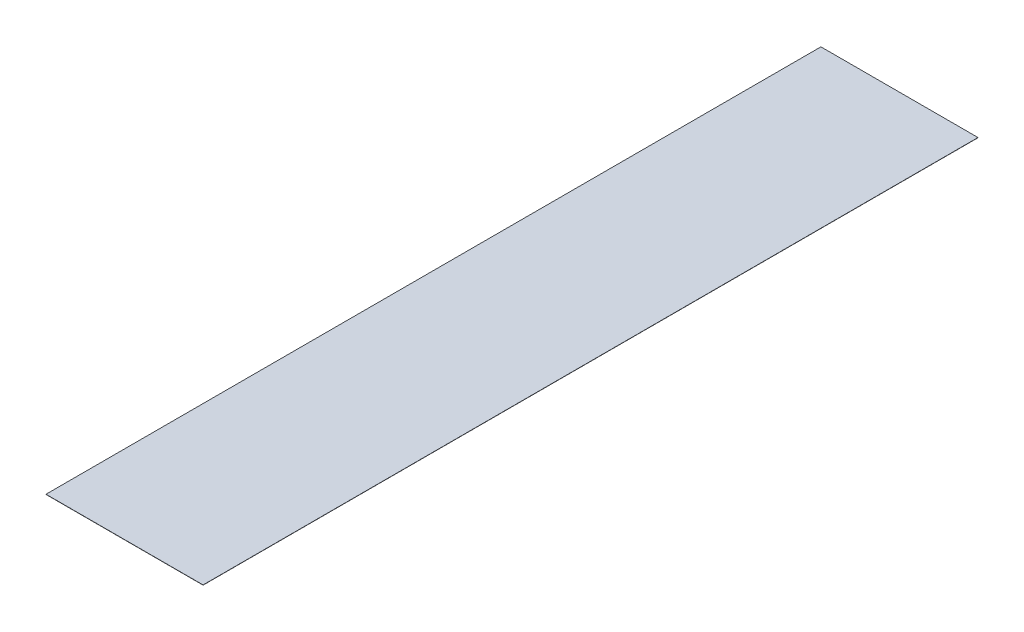
ISO-10303-21;
HEADER;
FILE_DESCRIPTION(('STEP AP214'),'2;1');
FILE_NAME('part.step','',(''),(''),'','','');
FILE_SCHEMA(('AUTOMOTIVE_DESIGN { 1 0 10303 214 1 1 1 1 }'));
ENDSEC;
DATA;
#1=APPLICATION_CONTEXT('core data for automotive mechanical design processes');
#2=APPLICATION_PROTOCOL_DEFINITION('international standard','automotive_design',2000,#1);
#3=PRODUCT_CONTEXT('',#1,'mechanical');
#4=PRODUCT('Part','Part','',(#3));
#5=PRODUCT_RELATED_PRODUCT_CATEGORY('part','',(#4));
#6=PRODUCT_DEFINITION_FORMATION('','',#4);
#7=PRODUCT_DEFINITION_CONTEXT('part definition',#1,'design');
#8=PRODUCT_DEFINITION('design','',#6,#7);
#9=PRODUCT_DEFINITION_SHAPE('','',#8);
#10=(LENGTH_UNIT() NAMED_UNIT(*) SI_UNIT(.MILLI.,.METRE.));
#11=(NAMED_UNIT(*) PLANE_ANGLE_UNIT() SI_UNIT($,.RADIAN.));
#12=(NAMED_UNIT(*) SI_UNIT($,.STERADIAN.) SOLID_ANGLE_UNIT());
#13=UNCERTAINTY_MEASURE_WITH_UNIT(LENGTH_MEASURE(1.E-05),#10,'distance_accuracy_value','');
#14=(GEOMETRIC_REPRESENTATION_CONTEXT(3) GLOBAL_UNCERTAINTY_ASSIGNED_CONTEXT((#13)) GLOBAL_UNIT_ASSIGNED_CONTEXT((#10,
#11,#12)) REPRESENTATION_CONTEXT('',''));
#15=CARTESIAN_POINT('',(0.,0.,0.));
#16=DIRECTION('',(0.,0.,1.));
#17=DIRECTION('',(1.,0.,0.));
#18=AXIS2_PLACEMENT_3D('',#15,#16,#17);
#19=CARTESIAN_POINT('',(0.,6.35,0.));
#20=DIRECTION('',(0.,1.,0.));
#21=DIRECTION('',(0.,0.,1.));
#22=AXIS2_PLACEMENT_3D('',#19,#20,#21);
#23=PLANE('',#22);
#24=DIRECTION('',(-1.,0.,0.));
#25=VECTOR('',#24,1.);
#26=CARTESIAN_POINT('',(2286.,6.35,-11277.6));
#27=LINE('',#26,#25);
#28=CARTESIAN_POINT('',(-2286.,6.35,-11277.6));
#29=VERTEX_POINT('',#28);
#30=CARTESIAN_POINT('',(2286.,6.35,-11277.6));
#31=VERTEX_POINT('',#30);
#32=EDGE_CURVE('E68',#29,#31,#27,.F.);
#33=ORIENTED_EDGE('',*,*,#32,.F.);
#34=DIRECTION('',(0.,0.,1.));
#35=VECTOR('',#34,1.);
#36=CARTESIAN_POINT('',(-2286.,6.35,-11277.6));
#37=LINE('',#36,#35);
#38=CARTESIAN_POINT('',(-2286.,6.35,11277.6));
#39=VERTEX_POINT('',#38);
#40=EDGE_CURVE('E20',#39,#29,#37,.F.);
#41=ORIENTED_EDGE('',*,*,#40,.F.);
#42=DIRECTION('',(1.,0.,0.));
#43=VECTOR('',#42,1.);
#44=CARTESIAN_POINT('',(-2286.,6.35,11277.6));
#45=LINE('',#44,#43);
#46=CARTESIAN_POINT('',(2286.,6.35,11277.6));
#47=VERTEX_POINT('',#46);
#48=EDGE_CURVE('E58',#47,#39,#45,.F.);
#49=ORIENTED_EDGE('',*,*,#48,.F.);
#50=DIRECTION('',(0.,0.,-1.));
#51=VECTOR('',#50,1.);
#52=CARTESIAN_POINT('',(2286.,6.35,11277.6));
#53=LINE('',#52,#51);
#54=EDGE_CURVE('E53',#31,#47,#53,.F.);
#55=ORIENTED_EDGE('',*,*,#54,.F.);
#56=EDGE_LOOP('',(#33,#41,#49,#55));
#57=FACE_BOUND('',#56,.T.);
#58=ADVANCED_FACE('F17',(#57),#23,.T.);
#59=CARTESIAN_POINT('',(-2286.,0.,-11277.6));
#60=DIRECTION('',(-1.,0.,0.));
#61=DIRECTION('',(0.,0.,1.));
#62=AXIS2_PLACEMENT_3D('',#59,#60,#61);
#63=PLANE('',#62);
#64=DIRECTION('',(0.,1.,0.));
#65=VECTOR('',#64,1.);
#66=CARTESIAN_POINT('',(-2286.,0.,-11277.6));
#67=LINE('',#66,#65);
#68=CARTESIAN_POINT('',(-2286.,0.,-11277.6));
#69=VERTEX_POINT('',#68);
#70=EDGE_CURVE('E79',#69,#29,#67,.T.);
#71=ORIENTED_EDGE('',*,*,#70,.F.);
#72=DIRECTION('',(0.,0.,1.));
#73=VECTOR('',#72,1.);
#74=CARTESIAN_POINT('',(-2286.,0.,0.));
#75=LINE('',#74,#73);
#76=CARTESIAN_POINT('',(-2286.,0.,11277.6));
#77=VERTEX_POINT('',#76);
#78=EDGE_CURVE('E74',#69,#77,#75,.T.);
#79=ORIENTED_EDGE('',*,*,#78,.T.);
#80=DIRECTION('',(0.,1.,0.));
#81=VECTOR('',#80,1.);
#82=CARTESIAN_POINT('',(-2286.,0.,11277.6));
#83=LINE('',#82,#81);
#84=EDGE_CURVE('E63',#39,#77,#83,.F.);
#85=ORIENTED_EDGE('',*,*,#84,.F.);
#86=ORIENTED_EDGE('',*,*,#40,.T.);
#87=EDGE_LOOP('',(#71,#79,#85,#86));
#88=FACE_BOUND('',#87,.T.);
#89=ADVANCED_FACE('F73',(#88),#63,.T.);
#90=CARTESIAN_POINT('',(-2286.,0.,11277.6));
#91=DIRECTION('',(0.,0.,1.));
#92=DIRECTION('',(1.,0.,0.));
#93=AXIS2_PLACEMENT_3D('',#90,#91,#92);
#94=PLANE('',#93);
#95=ORIENTED_EDGE('',*,*,#84,.T.);
#96=DIRECTION('',(1.,0.,0.));
#97=VECTOR('',#96,1.);
#98=CARTESIAN_POINT('',(0.,0.,11277.6));
#99=LINE('',#98,#97);
#100=CARTESIAN_POINT('',(2286.,0.,11277.6));
#101=VERTEX_POINT('',#100);
#102=EDGE_CURVE('E84',#77,#101,#99,.T.);
#103=ORIENTED_EDGE('',*,*,#102,.T.);
#104=DIRECTION('',(0.,1.,0.));
#105=VECTOR('',#104,1.);
#106=CARTESIAN_POINT('',(2286.,0.,11277.6));
#107=LINE('',#106,#105);
#108=EDGE_CURVE('E65',#47,#101,#107,.F.);
#109=ORIENTED_EDGE('',*,*,#108,.F.);
#110=ORIENTED_EDGE('',*,*,#48,.T.);
#111=EDGE_LOOP('',(#95,#103,#109,#110));
#112=FACE_BOUND('',#111,.T.);
#113=ADVANCED_FACE('F60',(#112),#94,.T.);
#114=CARTESIAN_POINT('',(2286.,0.,11277.6));
#115=DIRECTION('',(1.,0.,0.));
#116=DIRECTION('',(0.,0.,-1.));
#117=AXIS2_PLACEMENT_3D('',#114,#115,#116);
#118=PLANE('',#117);
#119=ORIENTED_EDGE('',*,*,#108,.T.);
#120=DIRECTION('',(0.,0.,1.));
#121=VECTOR('',#120,1.);
#122=CARTESIAN_POINT('',(2286.,0.,0.));
#123=LINE('',#122,#121);
#124=CARTESIAN_POINT('',(2286.,0.,-11277.6));
#125=VERTEX_POINT('',#124);
#126=EDGE_CURVE('E26',#101,#125,#123,.F.);
#127=ORIENTED_EDGE('',*,*,#126,.T.);
#128=DIRECTION('',(0.,1.,0.));
#129=VECTOR('',#128,1.);
#130=CARTESIAN_POINT('',(2286.,0.,-11277.6));
#131=LINE('',#130,#129);
#132=EDGE_CURVE('E34',#31,#125,#131,.F.);
#133=ORIENTED_EDGE('',*,*,#132,.F.);
#134=ORIENTED_EDGE('',*,*,#54,.T.);
#135=EDGE_LOOP('',(#119,#127,#133,#134));
#136=FACE_BOUND('',#135,.T.);
#137=ADVANCED_FACE('F88',(#136),#118,.T.);
#138=CARTESIAN_POINT('',(2286.,0.,-11277.6));
#139=DIRECTION('',(0.,0.,-1.));
#140=DIRECTION('',(-1.,0.,0.));
#141=AXIS2_PLACEMENT_3D('',#138,#139,#140);
#142=PLANE('',#141);
#143=ORIENTED_EDGE('',*,*,#132,.T.);
#144=DIRECTION('',(1.,0.,0.));
#145=VECTOR('',#144,1.);
#146=CARTESIAN_POINT('',(0.,0.,-11277.6));
#147=LINE('',#146,#145);
#148=EDGE_CURVE('E11',#125,#69,#147,.F.);
#149=ORIENTED_EDGE('',*,*,#148,.T.);
#150=ORIENTED_EDGE('',*,*,#70,.T.);
#151=ORIENTED_EDGE('',*,*,#32,.T.);
#152=EDGE_LOOP('',(#143,#149,#150,#151));
#153=FACE_BOUND('',#152,.T.);
#154=ADVANCED_FACE('F91',(#153),#142,.T.);
#155=CARTESIAN_POINT('',(0.,0.,0.));
#156=DIRECTION('',(0.,1.,0.));
#157=DIRECTION('',(0.,0.,1.));
#158=AXIS2_PLACEMENT_3D('',#155,#156,#157);
#159=PLANE('',#158);
#160=ORIENTED_EDGE('',*,*,#126,.F.);
#161=ORIENTED_EDGE('',*,*,#102,.F.);
#162=ORIENTED_EDGE('',*,*,#78,.F.);
#163=ORIENTED_EDGE('',*,*,#148,.F.);
#164=EDGE_LOOP('',(#160,#161,#162,#163));
#165=FACE_BOUND('',#164,.T.);
#166=ADVANCED_FACE('F90',(#165),#159,.F.);
#167=CLOSED_SHELL('',(#58,#89,#113,#137,#154,#166));
#168=MANIFOLD_SOLID_BREP('B1',#167);
#169=ADVANCED_BREP_SHAPE_REPRESENTATION('',(#18,#168),#14);
#170=SHAPE_DEFINITION_REPRESENTATION(#9,#169);
ENDSEC;
END-ISO-10303-21;
